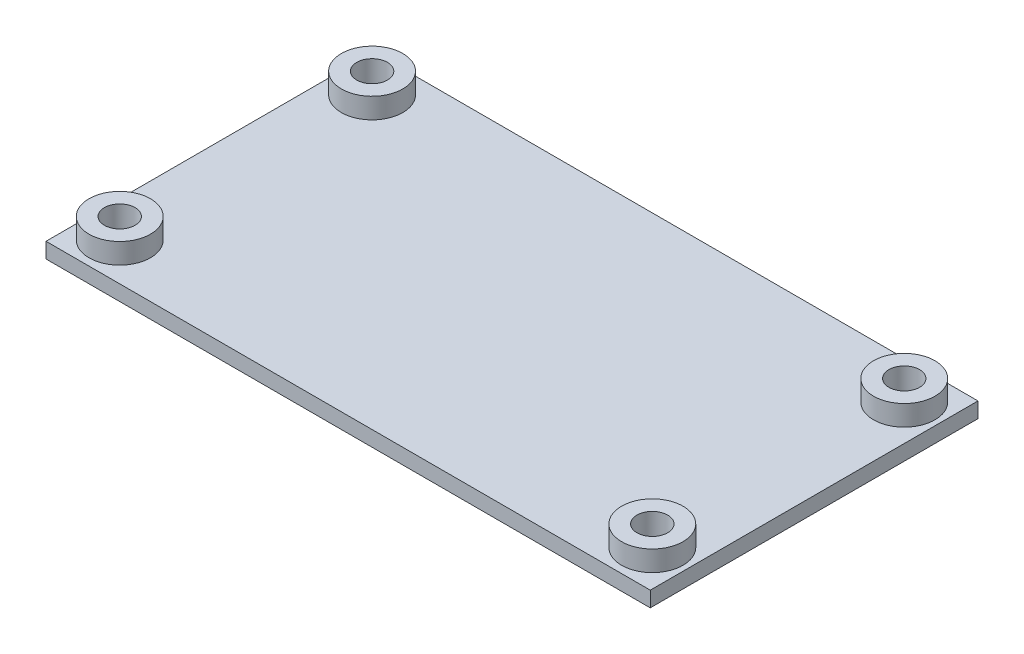
ISO-10303-21;
HEADER;
FILE_DESCRIPTION(('STEP AP214'),'2;1');
FILE_NAME('part.step','',(''),(''),'','','');
FILE_SCHEMA(('AUTOMOTIVE_DESIGN { 1 0 10303 214 1 1 1 1 }'));
ENDSEC;
DATA;
#1=APPLICATION_CONTEXT('core data for automotive mechanical design processes');
#2=APPLICATION_PROTOCOL_DEFINITION('international standard','automotive_design',2000,#1);
#3=PRODUCT_CONTEXT('',#1,'mechanical');
#4=PRODUCT('Part','Part','',(#3));
#5=PRODUCT_RELATED_PRODUCT_CATEGORY('part','',(#4));
#6=PRODUCT_DEFINITION_FORMATION('','',#4);
#7=PRODUCT_DEFINITION_CONTEXT('part definition',#1,'design');
#8=PRODUCT_DEFINITION('design','',#6,#7);
#9=PRODUCT_DEFINITION_SHAPE('','',#8);
#10=(LENGTH_UNIT() NAMED_UNIT(*) SI_UNIT(.MILLI.,.METRE.));
#11=(NAMED_UNIT(*) PLANE_ANGLE_UNIT() SI_UNIT($,.RADIAN.));
#12=(NAMED_UNIT(*) SI_UNIT($,.STERADIAN.) SOLID_ANGLE_UNIT());
#13=UNCERTAINTY_MEASURE_WITH_UNIT(LENGTH_MEASURE(1.E-05),#10,'distance_accuracy_value','');
#14=(GEOMETRIC_REPRESENTATION_CONTEXT(3) GLOBAL_UNCERTAINTY_ASSIGNED_CONTEXT((#13)) GLOBAL_UNIT_ASSIGNED_CONTEXT((#10,
#11,#12)) REPRESENTATION_CONTEXT('',''));
#15=CARTESIAN_POINT('',(0.,0.,0.));
#16=DIRECTION('',(0.,0.,1.));
#17=DIRECTION('',(1.,0.,0.));
#18=AXIS2_PLACEMENT_3D('',#15,#16,#17);
#19=CARTESIAN_POINT('',(-22.0993702767908,5.5,-7.76567380724461));
#20=DIRECTION('',(0.,-1.,0.));
#21=DIRECTION('',(0.,0.,-1.));
#22=AXIS2_PLACEMENT_3D('',#19,#20,#21);
#23=CYLINDRICAL_SURFACE('',#22,3.);
#24=CARTESIAN_POINT('',(-22.0993702767908,1.5,-7.76567380724461));
#25=DIRECTION('',(0.,1.,0.));
#26=DIRECTION('',(0.,0.,1.));
#27=AXIS2_PLACEMENT_3D('',#24,#25,#26);
#28=CIRCLE('',#27,3.);
#29=CARTESIAN_POINT('',(-22.0993702767908,1.5,-4.76567380724461));
#30=VERTEX_POINT('',#29);
#31=EDGE_CURVE('E115',#30,#30,#28,.T.);
#32=ORIENTED_EDGE('',*,*,#31,.T.);
#33=EDGE_LOOP('',(#32));
#34=FACE_BOUND('',#33,.T.);
#35=CARTESIAN_POINT('',(-22.0993702767908,3.5,-7.76567380724461));
#36=DIRECTION('',(0.,1.,0.));
#37=DIRECTION('',(0.,0.,1.));
#38=AXIS2_PLACEMENT_3D('',#35,#36,#37);
#39=CIRCLE('',#38,3.);
#40=CARTESIAN_POINT('',(-22.0993702767908,3.5,-4.76567380724461));
#41=VERTEX_POINT('',#40);
#42=EDGE_CURVE('E145',#41,#41,#39,.T.);
#43=ORIENTED_EDGE('',*,*,#42,.F.);
#44=EDGE_LOOP('',(#43));
#45=FACE_BOUND('',#44,.T.);
#46=ADVANCED_FACE('F35',(#34,#45),#23,.T.);
#47=CARTESIAN_POINT('',(-22.1381011434435,5.5,16.8343261927554));
#48=DIRECTION('',(0.,-1.,0.));
#49=DIRECTION('',(0.,0.,-1.));
#50=AXIS2_PLACEMENT_3D('',#47,#48,#49);
#51=CYLINDRICAL_SURFACE('',#50,3.);
#52=CARTESIAN_POINT('',(-22.1381011434435,1.5,16.8343261927554));
#53=DIRECTION('',(0.,1.,0.));
#54=DIRECTION('',(0.,0.,1.));
#55=AXIS2_PLACEMENT_3D('',#52,#53,#54);
#56=CIRCLE('',#55,3.);
#57=CARTESIAN_POINT('',(-22.1381011434435,1.5,19.8343261927554));
#58=VERTEX_POINT('',#57);
#59=EDGE_CURVE('E121',#58,#58,#56,.F.);
#60=ORIENTED_EDGE('',*,*,#59,.F.);
#61=EDGE_LOOP('',(#60));
#62=FACE_BOUND('',#61,.T.);
#63=CARTESIAN_POINT('',(-22.1381011434435,3.5,16.8343261927554));
#64=DIRECTION('',(0.,1.,0.));
#65=DIRECTION('',(0.,0.,1.));
#66=AXIS2_PLACEMENT_3D('',#63,#64,#65);
#67=CIRCLE('',#66,3.);
#68=CARTESIAN_POINT('',(-22.1381011434435,3.5,19.8343261927554));
#69=VERTEX_POINT('',#68);
#70=EDGE_CURVE('E102',#69,#69,#67,.T.);
#71=ORIENTED_EDGE('',*,*,#70,.F.);
#72=EDGE_LOOP('',(#71));
#73=FACE_BOUND('',#72,.T.);
#74=ADVANCED_FACE('F132',(#62,#73),#51,.T.);
#75=CARTESIAN_POINT('',(29.8618988565565,5.5,-7.76567380724461));
#76=DIRECTION('',(0.,-1.,0.));
#77=DIRECTION('',(0.,0.,-1.));
#78=AXIS2_PLACEMENT_3D('',#75,#76,#77);
#79=CYLINDRICAL_SURFACE('',#78,3.);
#80=CARTESIAN_POINT('',(29.8618988565565,1.5,-7.76567380724461));
#81=DIRECTION('',(0.,1.,0.));
#82=DIRECTION('',(0.,0.,1.));
#83=AXIS2_PLACEMENT_3D('',#80,#81,#82);
#84=CIRCLE('',#83,3.);
#85=CARTESIAN_POINT('',(29.8618988565565,1.5,-4.76567380724461));
#86=VERTEX_POINT('',#85);
#87=EDGE_CURVE('E44',#86,#86,#84,.F.);
#88=ORIENTED_EDGE('',*,*,#87,.F.);
#89=EDGE_LOOP('',(#88));
#90=FACE_BOUND('',#89,.T.);
#91=CARTESIAN_POINT('',(29.8618988565565,3.5,-7.76567380724461));
#92=DIRECTION('',(0.,1.,0.));
#93=DIRECTION('',(0.,0.,1.));
#94=AXIS2_PLACEMENT_3D('',#91,#92,#93);
#95=CIRCLE('',#94,3.);
#96=CARTESIAN_POINT('',(29.8618988565565,3.5,-4.76567380724461));
#97=VERTEX_POINT('',#96);
#98=EDGE_CURVE('E136',#97,#97,#95,.T.);
#99=ORIENTED_EDGE('',*,*,#98,.F.);
#100=EDGE_LOOP('',(#99));
#101=FACE_BOUND('',#100,.T.);
#102=ADVANCED_FACE('F128',(#90,#101),#79,.T.);
#103=CARTESIAN_POINT('',(29.8618988565565,5.5,16.8343261927554));
#104=DIRECTION('',(0.,-1.,0.));
#105=DIRECTION('',(0.,0.,-1.));
#106=AXIS2_PLACEMENT_3D('',#103,#104,#105);
#107=CYLINDRICAL_SURFACE('',#106,3.);
#108=CARTESIAN_POINT('',(29.8618988565565,1.5,16.8343261927554));
#109=DIRECTION('',(0.,1.,0.));
#110=DIRECTION('',(0.,0.,1.));
#111=AXIS2_PLACEMENT_3D('',#108,#109,#110);
#112=CIRCLE('',#111,3.);
#113=CARTESIAN_POINT('',(29.8618988565565,1.5,19.8343261927554));
#114=VERTEX_POINT('',#113);
#115=EDGE_CURVE('E11',#114,#114,#112,.F.);
#116=ORIENTED_EDGE('',*,*,#115,.F.);
#117=EDGE_LOOP('',(#116));
#118=FACE_BOUND('',#117,.T.);
#119=CARTESIAN_POINT('',(29.8618988565565,3.5,16.8343261927554));
#120=DIRECTION('',(0.,1.,0.));
#121=DIRECTION('',(0.,0.,1.));
#122=AXIS2_PLACEMENT_3D('',#119,#120,#121);
#123=CIRCLE('',#122,3.);
#124=CARTESIAN_POINT('',(29.8618988565565,3.5,19.8343261927554));
#125=VERTEX_POINT('',#124);
#126=EDGE_CURVE('E142',#125,#125,#123,.T.);
#127=ORIENTED_EDGE('',*,*,#126,.F.);
#128=EDGE_LOOP('',(#127));
#129=FACE_BOUND('',#128,.T.);
#130=ADVANCED_FACE('F131',(#118,#129),#107,.T.);
#131=CARTESIAN_POINT('',(0.,1.5,0.));
#132=DIRECTION('',(0.,1.,0.));
#133=DIRECTION('',(0.,0.,1.));
#134=AXIS2_PLACEMENT_3D('',#131,#132,#133);
#135=PLANE('',#134);
#136=DIRECTION('',(0.,0.,-1.));
#137=VECTOR('',#136,1.);
#138=CARTESIAN_POINT('',(33.3618988565565,1.5,-11.4656738072446));
#139=LINE('',#138,#137);
#140=CARTESIAN_POINT('',(33.3618988565565,1.5,20.5343261927554));
#141=VERTEX_POINT('',#140);
#142=CARTESIAN_POINT('',(33.3618988565565,1.5,-11.4656738072446));
#143=VERTEX_POINT('',#142);
#144=EDGE_CURVE('E83',#141,#143,#139,.T.);
#145=ORIENTED_EDGE('',*,*,#144,.T.);
#146=DIRECTION('',(1.,0.,0.));
#147=VECTOR('',#146,1.);
#148=CARTESIAN_POINT('',(-24.6381011434435,1.5,-11.4656738072446));
#149=LINE('',#148,#147);
#150=CARTESIAN_POINT('',(-25.6381011434435,1.5,-11.4656738072446));
#151=VERTEX_POINT('',#150);
#152=EDGE_CURVE('E116',#151,#143,#149,.T.);
#153=ORIENTED_EDGE('',*,*,#152,.F.);
#154=DIRECTION('',(0.,0.,1.));
#155=VECTOR('',#154,1.);
#156=CARTESIAN_POINT('',(-25.6381011434435,1.5,-11.4656738072446));
#157=LINE('',#156,#155);
#158=CARTESIAN_POINT('',(-25.6381011434435,1.5,20.5343261927554));
#159=VERTEX_POINT('',#158);
#160=EDGE_CURVE('E85',#151,#159,#157,.T.);
#161=ORIENTED_EDGE('',*,*,#160,.T.);
#162=DIRECTION('',(-1.,0.,0.));
#163=VECTOR('',#162,1.);
#164=CARTESIAN_POINT('',(-24.6381011434435,1.5,20.5343261927554));
#165=LINE('',#164,#163);
#166=EDGE_CURVE('E78',#141,#159,#165,.T.);
#167=ORIENTED_EDGE('',*,*,#166,.F.);
#168=EDGE_LOOP('',(#145,#153,#161,#167));
#169=FACE_BOUND('',#168,.T.);
#170=ORIENTED_EDGE('',*,*,#87,.T.);
#171=EDGE_LOOP('',(#170));
#172=FACE_BOUND('',#171,.T.);
#173=ORIENTED_EDGE('',*,*,#115,.T.);
#174=EDGE_LOOP('',(#173));
#175=FACE_BOUND('',#174,.T.);
#176=ORIENTED_EDGE('',*,*,#59,.T.);
#177=EDGE_LOOP('',(#176));
#178=FACE_BOUND('',#177,.T.);
#179=ORIENTED_EDGE('',*,*,#31,.F.);
#180=EDGE_LOOP('',(#179));
#181=FACE_BOUND('',#180,.T.);
#182=ADVANCED_FACE('F80',(#169,#172,#175,#178,#181),#135,.T.);
#183=CARTESIAN_POINT('',(0.,0.,0.));
#184=DIRECTION('',(0.,1.,0.));
#185=DIRECTION('',(0.,0.,1.));
#186=AXIS2_PLACEMENT_3D('',#183,#184,#185);
#187=PLANE('',#186);
#188=CARTESIAN_POINT('',(-22.1381011434435,0.,16.8343261927554));
#189=DIRECTION('',(0.,-1.,0.));
#190=DIRECTION('',(0.,0.,-1.));
#191=AXIS2_PLACEMENT_3D('',#188,#189,#190);
#192=CIRCLE('',#191,1.5);
#193=CARTESIAN_POINT('',(-22.1381011434435,0.,15.3343261927554));
#194=VERTEX_POINT('',#193);
#195=EDGE_CURVE('E164',#194,#194,#192,.T.);
#196=ORIENTED_EDGE('',*,*,#195,.F.);
#197=EDGE_LOOP('',(#196));
#198=FACE_BOUND('',#197,.T.);
#199=CARTESIAN_POINT('',(-22.0993702767908,0.,-7.76567380724461));
#200=DIRECTION('',(0.,-1.,0.));
#201=DIRECTION('',(0.,0.,-1.));
#202=AXIS2_PLACEMENT_3D('',#199,#200,#201);
#203=CIRCLE('',#202,1.5);
#204=CARTESIAN_POINT('',(-22.0993702767908,0.,-9.26567380724461));
#205=VERTEX_POINT('',#204);
#206=EDGE_CURVE('E167',#205,#205,#203,.T.);
#207=ORIENTED_EDGE('',*,*,#206,.F.);
#208=EDGE_LOOP('',(#207));
#209=FACE_BOUND('',#208,.T.);
#210=CARTESIAN_POINT('',(29.8618988565565,0.,-7.76567380724461));
#211=DIRECTION('',(0.,-1.,0.));
#212=DIRECTION('',(0.,0.,-1.));
#213=AXIS2_PLACEMENT_3D('',#210,#211,#212);
#214=CIRCLE('',#213,1.5);
#215=CARTESIAN_POINT('',(29.8618988565565,0.,-9.26567380724462));
#216=VERTEX_POINT('',#215);
#217=EDGE_CURVE('E163',#216,#216,#214,.T.);
#218=ORIENTED_EDGE('',*,*,#217,.F.);
#219=EDGE_LOOP('',(#218));
#220=FACE_BOUND('',#219,.T.);
#221=CARTESIAN_POINT('',(29.8618988565565,0.,16.8343261927554));
#222=DIRECTION('',(0.,-1.,0.));
#223=DIRECTION('',(0.,0.,-1.));
#224=AXIS2_PLACEMENT_3D('',#221,#222,#223);
#225=CIRCLE('',#224,1.5);
#226=CARTESIAN_POINT('',(29.8618988565565,0.,15.3343261927554));
#227=VERTEX_POINT('',#226);
#228=EDGE_CURVE('E152',#227,#227,#225,.T.);
#229=ORIENTED_EDGE('',*,*,#228,.F.);
#230=EDGE_LOOP('',(#229));
#231=FACE_BOUND('',#230,.T.);
#232=DIRECTION('',(-1.,0.,0.));
#233=VECTOR('',#232,1.);
#234=CARTESIAN_POINT('',(-24.6381011434435,0.,20.5343261927554));
#235=LINE('',#234,#233);
#236=CARTESIAN_POINT('',(33.3618988565565,0.,20.5343261927554));
#237=VERTEX_POINT('',#236);
#238=CARTESIAN_POINT('',(-25.6381011434435,0.,20.5343261927554));
#239=VERTEX_POINT('',#238);
#240=EDGE_CURVE('E58',#237,#239,#235,.T.);
#241=ORIENTED_EDGE('',*,*,#240,.T.);
#242=DIRECTION('',(0.,0.,-1.));
#243=VECTOR('',#242,1.);
#244=CARTESIAN_POINT('',(-25.6381011434435,0.,-11.4656738072446));
#245=LINE('',#244,#243);
#246=CARTESIAN_POINT('',(-25.6381011434435,0.,-11.4656738072446));
#247=VERTEX_POINT('',#246);
#248=EDGE_CURVE('E89',#239,#247,#245,.T.);
#249=ORIENTED_EDGE('',*,*,#248,.T.);
#250=DIRECTION('',(1.,0.,0.));
#251=VECTOR('',#250,1.);
#252=CARTESIAN_POINT('',(-24.6381011434435,0.,-11.4656738072446));
#253=LINE('',#252,#251);
#254=CARTESIAN_POINT('',(33.3618988565565,0.,-11.4656738072446));
#255=VERTEX_POINT('',#254);
#256=EDGE_CURVE('E51',#247,#255,#253,.T.);
#257=ORIENTED_EDGE('',*,*,#256,.T.);
#258=DIRECTION('',(0.,0.,1.));
#259=VECTOR('',#258,1.);
#260=CARTESIAN_POINT('',(33.3618988565565,0.,-11.4656738072446));
#261=LINE('',#260,#259);
#262=EDGE_CURVE('E105',#255,#237,#261,.T.);
#263=ORIENTED_EDGE('',*,*,#262,.T.);
#264=EDGE_LOOP('',(#241,#249,#257,#263));
#265=FACE_BOUND('',#264,.T.);
#266=ADVANCED_FACE('F37',(#198,#209,#220,#231,#265),#187,.F.);
#267=CARTESIAN_POINT('',(-24.6381011434435,0.,20.5343261927554));
#268=DIRECTION('',(0.,0.,-1.));
#269=DIRECTION('',(-1.,0.,0.));
#270=AXIS2_PLACEMENT_3D('',#267,#268,#269);
#271=PLANE('',#270);
#272=ORIENTED_EDGE('',*,*,#166,.T.);
#273=DIRECTION('',(0.,1.,0.));
#274=VECTOR('',#273,1.);
#275=CARTESIAN_POINT('',(-25.6381011434435,-32.0156211871642,20.5343261927554));
#276=LINE('',#275,#274);
#277=EDGE_CURVE('E111',#239,#159,#276,.T.);
#278=ORIENTED_EDGE('',*,*,#277,.F.);
#279=ORIENTED_EDGE('',*,*,#240,.F.);
#280=DIRECTION('',(0.,1.,0.));
#281=VECTOR('',#280,1.);
#282=CARTESIAN_POINT('',(33.3618988565565,-32.0156211871642,20.5343261927554));
#283=LINE('',#282,#281);
#284=EDGE_CURVE('E92',#237,#141,#283,.T.);
#285=ORIENTED_EDGE('',*,*,#284,.T.);
#286=EDGE_LOOP('',(#272,#278,#279,#285));
#287=FACE_BOUND('',#286,.T.);
#288=ADVANCED_FACE('F93',(#287),#271,.F.);
#289=CARTESIAN_POINT('',(-24.6381011434435,0.,-11.4656738072446));
#290=DIRECTION('',(0.,0.,1.));
#291=DIRECTION('',(1.,0.,0.));
#292=AXIS2_PLACEMENT_3D('',#289,#290,#291);
#293=PLANE('',#292);
#294=ORIENTED_EDGE('',*,*,#152,.T.);
#295=DIRECTION('',(0.,1.,0.));
#296=VECTOR('',#295,1.);
#297=CARTESIAN_POINT('',(33.3618988565565,-32.0156211871642,-11.4656738072446));
#298=LINE('',#297,#296);
#299=EDGE_CURVE('E96',#255,#143,#298,.T.);
#300=ORIENTED_EDGE('',*,*,#299,.F.);
#301=ORIENTED_EDGE('',*,*,#256,.F.);
#302=DIRECTION('',(0.,1.,0.));
#303=VECTOR('',#302,1.);
#304=CARTESIAN_POINT('',(-25.6381011434435,-32.0156211871642,-11.4656738072446));
#305=LINE('',#304,#303);
#306=EDGE_CURVE('E109',#247,#151,#305,.T.);
#307=ORIENTED_EDGE('',*,*,#306,.T.);
#308=EDGE_LOOP('',(#294,#300,#301,#307));
#309=FACE_BOUND('',#308,.T.);
#310=ADVANCED_FACE('F247',(#309),#293,.F.);
#311=CARTESIAN_POINT('',(-25.6381011434435,-32.0156211871642,-11.4656738072446));
#312=DIRECTION('',(-1.,0.,0.));
#313=DIRECTION('',(0.,0.,1.));
#314=AXIS2_PLACEMENT_3D('',#311,#312,#313);
#315=PLANE('',#314);
#316=ORIENTED_EDGE('',*,*,#248,.F.);
#317=ORIENTED_EDGE('',*,*,#277,.T.);
#318=ORIENTED_EDGE('',*,*,#160,.F.);
#319=ORIENTED_EDGE('',*,*,#306,.F.);
#320=EDGE_LOOP('',(#316,#317,#318,#319));
#321=FACE_BOUND('',#320,.T.);
#322=ADVANCED_FACE('F244',(#321),#315,.T.);
#323=CARTESIAN_POINT('',(33.3618988565565,-32.0156211871642,-11.4656738072446));
#324=DIRECTION('',(1.,0.,0.));
#325=DIRECTION('',(0.,0.,-1.));
#326=AXIS2_PLACEMENT_3D('',#323,#324,#325);
#327=PLANE('',#326);
#328=ORIENTED_EDGE('',*,*,#262,.F.);
#329=ORIENTED_EDGE('',*,*,#299,.T.);
#330=ORIENTED_EDGE('',*,*,#144,.F.);
#331=ORIENTED_EDGE('',*,*,#284,.F.);
#332=EDGE_LOOP('',(#328,#329,#330,#331));
#333=FACE_BOUND('',#332,.T.);
#334=ADVANCED_FACE('F99',(#333),#327,.T.);
#335=CARTESIAN_POINT('',(29.8618988565565,3.5,16.8343261927554));
#336=DIRECTION('',(0.,1.,0.));
#337=DIRECTION('',(0.,0.,1.));
#338=AXIS2_PLACEMENT_3D('',#335,#336,#337);
#339=PLANE('',#338);
#340=CARTESIAN_POINT('',(29.8618988565565,3.5,16.8343261927554));
#341=DIRECTION('',(0.,1.,0.));
#342=DIRECTION('',(0.,0.,1.));
#343=AXIS2_PLACEMENT_3D('',#340,#341,#342);
#344=CIRCLE('',#343,1.5);
#345=CARTESIAN_POINT('',(29.8618988565565,3.5,18.3343261927554));
#346=VERTEX_POINT('',#345);
#347=EDGE_CURVE('E138',#346,#346,#344,.T.);
#348=ORIENTED_EDGE('',*,*,#347,.F.);
#349=EDGE_LOOP('',(#348));
#350=FACE_BOUND('',#349,.T.);
#351=ORIENTED_EDGE('',*,*,#126,.T.);
#352=EDGE_LOOP('',(#351));
#353=FACE_BOUND('',#352,.T.);
#354=ADVANCED_FACE('F238',(#350,#353),#339,.T.);
#355=CARTESIAN_POINT('',(29.8618988565565,3.5,-7.76567380724461));
#356=DIRECTION('',(0.,1.,0.));
#357=DIRECTION('',(0.,0.,1.));
#358=AXIS2_PLACEMENT_3D('',#355,#356,#357);
#359=PLANE('',#358);
#360=CARTESIAN_POINT('',(29.8618988565565,3.5,-7.76567380724461));
#361=DIRECTION('',(0.,1.,0.));
#362=DIRECTION('',(0.,0.,1.));
#363=AXIS2_PLACEMENT_3D('',#360,#361,#362);
#364=CIRCLE('',#363,1.5);
#365=CARTESIAN_POINT('',(29.8618988565565,3.5,-6.26567380724461));
#366=VERTEX_POINT('',#365);
#367=EDGE_CURVE('E139',#366,#366,#364,.T.);
#368=ORIENTED_EDGE('',*,*,#367,.F.);
#369=EDGE_LOOP('',(#368));
#370=FACE_BOUND('',#369,.T.);
#371=ORIENTED_EDGE('',*,*,#98,.T.);
#372=EDGE_LOOP('',(#371));
#373=FACE_BOUND('',#372,.T.);
#374=ADVANCED_FACE('F233',(#370,#373),#359,.T.);
#375=CARTESIAN_POINT('',(-22.1381011434435,3.5,16.8343261927554));
#376=DIRECTION('',(0.,1.,0.));
#377=DIRECTION('',(0.,0.,1.));
#378=AXIS2_PLACEMENT_3D('',#375,#376,#377);
#379=PLANE('',#378);
#380=CARTESIAN_POINT('',(-22.1381011434435,3.5,16.8343261927554));
#381=DIRECTION('',(0.,1.,0.));
#382=DIRECTION('',(0.,0.,1.));
#383=AXIS2_PLACEMENT_3D('',#380,#381,#382);
#384=CIRCLE('',#383,1.5);
#385=CARTESIAN_POINT('',(-22.1381011434435,3.5,18.3343261927554));
#386=VERTEX_POINT('',#385);
#387=EDGE_CURVE('E39',#386,#386,#384,.T.);
#388=ORIENTED_EDGE('',*,*,#387,.F.);
#389=EDGE_LOOP('',(#388));
#390=FACE_BOUND('',#389,.T.);
#391=ORIENTED_EDGE('',*,*,#70,.T.);
#392=EDGE_LOOP('',(#391));
#393=FACE_BOUND('',#392,.T.);
#394=ADVANCED_FACE('F192',(#390,#393),#379,.T.);
#395=CARTESIAN_POINT('',(-22.0993702767908,3.5,-7.76567380724461));
#396=DIRECTION('',(0.,1.,0.));
#397=DIRECTION('',(0.,0.,1.));
#398=AXIS2_PLACEMENT_3D('',#395,#396,#397);
#399=PLANE('',#398);
#400=CARTESIAN_POINT('',(-22.0993702767908,3.5,-7.76567380724461));
#401=DIRECTION('',(0.,1.,0.));
#402=DIRECTION('',(0.,0.,1.));
#403=AXIS2_PLACEMENT_3D('',#400,#401,#402);
#404=CIRCLE('',#403,1.5);
#405=CARTESIAN_POINT('',(-22.0993702767908,3.5,-6.26567380724461));
#406=VERTEX_POINT('',#405);
#407=EDGE_CURVE('E149',#406,#406,#404,.T.);
#408=ORIENTED_EDGE('',*,*,#407,.F.);
#409=EDGE_LOOP('',(#408));
#410=FACE_BOUND('',#409,.T.);
#411=ORIENTED_EDGE('',*,*,#42,.T.);
#412=EDGE_LOOP('',(#411));
#413=FACE_BOUND('',#412,.T.);
#414=ADVANCED_FACE('F182',(#410,#413),#399,.T.);
#415=CARTESIAN_POINT('',(29.8618988565565,5.5,16.8343261927554));
#416=DIRECTION('',(0.,-1.,0.));
#417=DIRECTION('',(0.,0.,-1.));
#418=AXIS2_PLACEMENT_3D('',#415,#416,#417);
#419=CYLINDRICAL_SURFACE('',#418,1.5);
#420=ORIENTED_EDGE('',*,*,#347,.T.);
#421=EDGE_LOOP('',(#420));
#422=FACE_BOUND('',#421,.T.);
#423=ORIENTED_EDGE('',*,*,#228,.T.);
#424=EDGE_LOOP('',(#423));
#425=FACE_BOUND('',#424,.T.);
#426=ADVANCED_FACE('F180',(#422,#425),#419,.F.);
#427=CARTESIAN_POINT('',(29.8618988565565,5.5,-7.76567380724461));
#428=DIRECTION('',(0.,-1.,0.));
#429=DIRECTION('',(0.,0.,-1.));
#430=AXIS2_PLACEMENT_3D('',#427,#428,#429);
#431=CYLINDRICAL_SURFACE('',#430,1.5);
#432=ORIENTED_EDGE('',*,*,#367,.T.);
#433=EDGE_LOOP('',(#432));
#434=FACE_BOUND('',#433,.T.);
#435=ORIENTED_EDGE('',*,*,#217,.T.);
#436=EDGE_LOOP('',(#435));
#437=FACE_BOUND('',#436,.T.);
#438=ADVANCED_FACE('F173',(#434,#437),#431,.F.);
#439=CARTESIAN_POINT('',(-22.1381011434435,5.5,16.8343261927554));
#440=DIRECTION('',(0.,-1.,0.));
#441=DIRECTION('',(0.,0.,-1.));
#442=AXIS2_PLACEMENT_3D('',#439,#440,#441);
#443=CYLINDRICAL_SURFACE('',#442,1.5);
#444=ORIENTED_EDGE('',*,*,#387,.T.);
#445=EDGE_LOOP('',(#444));
#446=FACE_BOUND('',#445,.T.);
#447=ORIENTED_EDGE('',*,*,#195,.T.);
#448=EDGE_LOOP('',(#447));
#449=FACE_BOUND('',#448,.T.);
#450=ADVANCED_FACE('F189',(#446,#449),#443,.F.);
#451=CARTESIAN_POINT('',(-22.0993702767908,5.5,-7.76567380724461));
#452=DIRECTION('',(0.,-1.,0.));
#453=DIRECTION('',(0.,0.,-1.));
#454=AXIS2_PLACEMENT_3D('',#451,#452,#453);
#455=CYLINDRICAL_SURFACE('',#454,1.5);
#456=ORIENTED_EDGE('',*,*,#407,.T.);
#457=EDGE_LOOP('',(#456));
#458=FACE_BOUND('',#457,.T.);
#459=ORIENTED_EDGE('',*,*,#206,.T.);
#460=EDGE_LOOP('',(#459));
#461=FACE_BOUND('',#460,.T.);
#462=ADVANCED_FACE('F207',(#458,#461),#455,.F.);
#463=CLOSED_SHELL('',(#46,#74,#102,#130,#182,#266,#288,#310,#322,#334,#354,#374,#394,#414,#426,
#438,#450,#462));
#464=MANIFOLD_SOLID_BREP('B2',#463);
#465=ADVANCED_BREP_SHAPE_REPRESENTATION('',(#18,#464),#14);
#466=SHAPE_DEFINITION_REPRESENTATION(#9,#465);
ENDSEC;
END-ISO-10303-21;
